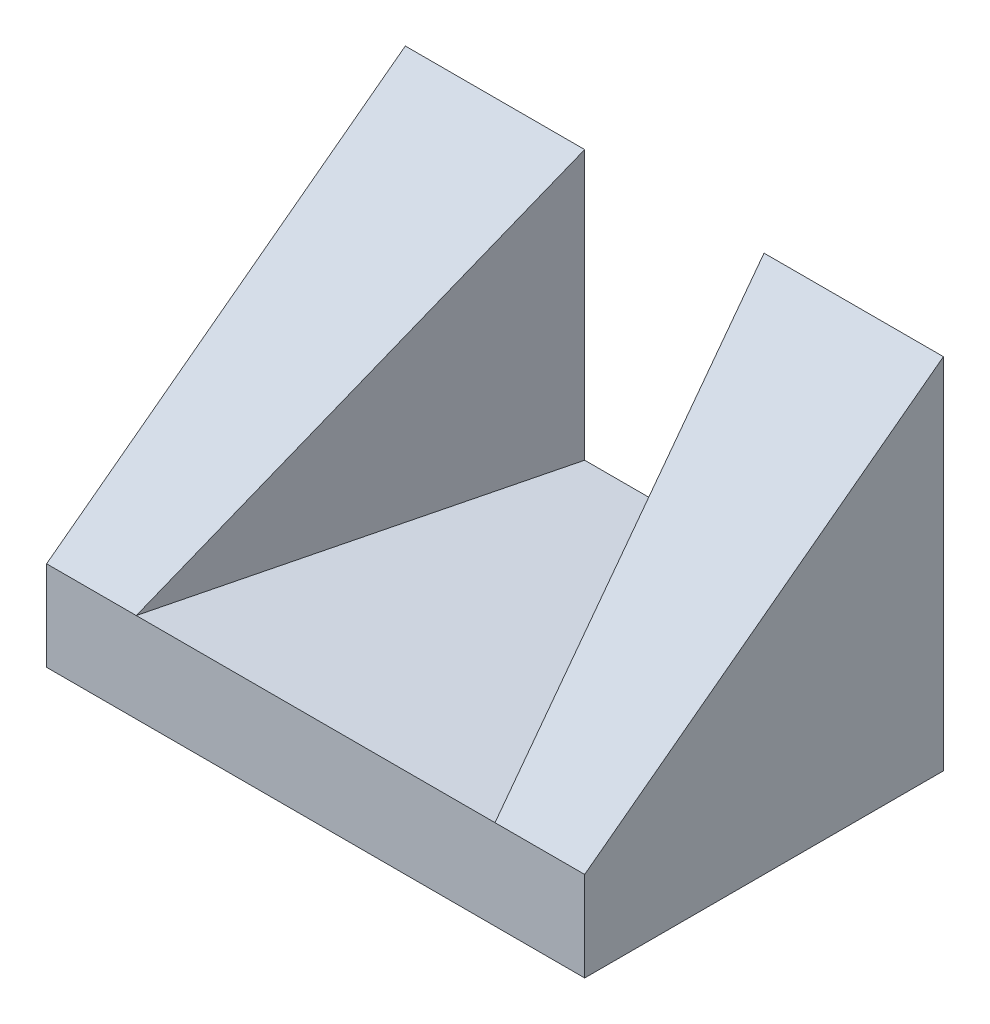
ISO-10303-21;
HEADER;
FILE_DESCRIPTION(('STEP AP214'),'2;1');
FILE_NAME('part.step','',(''),(''),'','','');
FILE_SCHEMA(('AUTOMOTIVE_DESIGN { 1 0 10303 214 1 1 1 1 }'));
ENDSEC;
DATA;
#1=APPLICATION_CONTEXT('core data for automotive mechanical design processes');
#2=APPLICATION_PROTOCOL_DEFINITION('international standard','automotive_design',2000,#1);
#3=PRODUCT_CONTEXT('',#1,'mechanical');
#4=PRODUCT('Part','Part','',(#3));
#5=PRODUCT_RELATED_PRODUCT_CATEGORY('part','',(#4));
#6=PRODUCT_DEFINITION_FORMATION('','',#4);
#7=PRODUCT_DEFINITION_CONTEXT('part definition',#1,'design');
#8=PRODUCT_DEFINITION('design','',#6,#7);
#9=PRODUCT_DEFINITION_SHAPE('','',#8);
#10=(LENGTH_UNIT() NAMED_UNIT(*) SI_UNIT(.MILLI.,.METRE.));
#11=(NAMED_UNIT(*) PLANE_ANGLE_UNIT() SI_UNIT($,.RADIAN.));
#12=(NAMED_UNIT(*) SI_UNIT($,.STERADIAN.) SOLID_ANGLE_UNIT());
#13=UNCERTAINTY_MEASURE_WITH_UNIT(LENGTH_MEASURE(1.E-05),#10,'distance_accuracy_value','');
#14=(GEOMETRIC_REPRESENTATION_CONTEXT(3) GLOBAL_UNCERTAINTY_ASSIGNED_CONTEXT((#13)) GLOBAL_UNIT_ASSIGNED_CONTEXT((#10,
#11,#12)) REPRESENTATION_CONTEXT('',''));
#15=CARTESIAN_POINT('',(0.,0.,0.));
#16=DIRECTION('',(0.,0.,1.));
#17=DIRECTION('',(1.,0.,0.));
#18=AXIS2_PLACEMENT_3D('',#15,#16,#17);
#19=CARTESIAN_POINT('',(0.,1.,0.));
#20=DIRECTION('',(0.,1.,0.));
#21=DIRECTION('',(0.,0.,1.));
#22=AXIS2_PLACEMENT_3D('',#19,#20,#21);
#23=PLANE('',#22);
#24=DIRECTION('',(1.,0.,0.));
#25=VECTOR('',#24,1.);
#26=CARTESIAN_POINT('',(0.,1.,2.));
#27=LINE('',#26,#25);
#28=CARTESIAN_POINT('',(-2.,1.,2.));
#29=VERTEX_POINT('',#28);
#30=CARTESIAN_POINT('',(2.,1.,2.));
#31=VERTEX_POINT('',#30);
#32=EDGE_CURVE('E119',#29,#31,#27,.T.);
#33=ORIENTED_EDGE('',*,*,#32,.T.);
#34=DIRECTION('',(-0.242535625036333,0.,-0.970142500145332));
#35=VECTOR('',#34,1.);
#36=CARTESIAN_POINT('',(1.41176470588235,1.,-0.352941176470589));
#37=LINE('',#36,#35);
#38=CARTESIAN_POINT('',(1.,1.,-2.));
#39=VERTEX_POINT('',#38);
#40=EDGE_CURVE('E50',#31,#39,#37,.T.);
#41=ORIENTED_EDGE('',*,*,#40,.T.);
#42=DIRECTION('',(1.,0.,0.));
#43=VECTOR('',#42,1.);
#44=CARTESIAN_POINT('',(0.,1.,-2.));
#45=LINE('',#44,#43);
#46=CARTESIAN_POINT('',(-0.999999999999999,1.,-2.));
#47=VERTEX_POINT('',#46);
#48=EDGE_CURVE('E124',#47,#39,#45,.T.);
#49=ORIENTED_EDGE('',*,*,#48,.F.);
#50=DIRECTION('',(0.242535625036333,0.,-0.970142500145332));
#51=VECTOR('',#50,1.);
#52=CARTESIAN_POINT('',(-1.41176470588235,1.,-0.352941176470587));
#53=LINE('',#52,#51);
#54=EDGE_CURVE('E129',#29,#47,#53,.T.);
#55=ORIENTED_EDGE('',*,*,#54,.F.);
#56=EDGE_LOOP('',(#33,#41,#49,#55));
#57=FACE_BOUND('',#56,.T.);
#58=ADVANCED_FACE('F35',(#57),#23,.T.);
#59=CARTESIAN_POINT('',(0.,1.,-2.));
#60=DIRECTION('',(0.,0.,-1.));
#61=DIRECTION('',(-1.,0.,0.));
#62=AXIS2_PLACEMENT_3D('',#59,#60,#61);
#63=PLANE('',#62);
#64=DIRECTION('',(0.,-1.,0.));
#65=VECTOR('',#64,1.);
#66=CARTESIAN_POINT('',(3.,1.,-2.));
#67=LINE('',#66,#65);
#68=CARTESIAN_POINT('',(3.,4.,-2.));
#69=VERTEX_POINT('',#68);
#70=CARTESIAN_POINT('',(3.,0.,-2.));
#71=VERTEX_POINT('',#70);
#72=EDGE_CURVE('E112',#69,#71,#67,.T.);
#73=ORIENTED_EDGE('',*,*,#72,.T.);
#74=DIRECTION('',(1.,0.,0.));
#75=VECTOR('',#74,1.);
#76=CARTESIAN_POINT('',(0.,0.,-2.));
#77=LINE('',#76,#75);
#78=CARTESIAN_POINT('',(-3.,0.,-2.));
#79=VERTEX_POINT('',#78);
#80=EDGE_CURVE('E58',#79,#71,#77,.T.);
#81=ORIENTED_EDGE('',*,*,#80,.F.);
#82=DIRECTION('',(0.,-1.,0.));
#83=VECTOR('',#82,1.);
#84=CARTESIAN_POINT('',(-3.,1.,-2.));
#85=LINE('',#84,#83);
#86=CARTESIAN_POINT('',(-3.,4.,-2.));
#87=VERTEX_POINT('',#86);
#88=EDGE_CURVE('E11',#87,#79,#85,.T.);
#89=ORIENTED_EDGE('',*,*,#88,.F.);
#90=DIRECTION('',(1.,0.,0.));
#91=VECTOR('',#90,1.);
#92=CARTESIAN_POINT('',(0.,4.,-2.));
#93=LINE('',#92,#91);
#94=CARTESIAN_POINT('',(-0.999999999999999,4.,-2.));
#95=VERTEX_POINT('',#94);
#96=EDGE_CURVE('E137',#87,#95,#93,.T.);
#97=ORIENTED_EDGE('',*,*,#96,.T.);
#98=DIRECTION('',(0.,-1.,0.));
#99=VECTOR('',#98,1.);
#100=CARTESIAN_POINT('',(-0.999999999999999,4.,-2.));
#101=LINE('',#100,#99);
#102=EDGE_CURVE('E134',#95,#47,#101,.T.);
#103=ORIENTED_EDGE('',*,*,#102,.T.);
#104=ORIENTED_EDGE('',*,*,#48,.T.);
#105=DIRECTION('',(0.,-1.,0.));
#106=VECTOR('',#105,1.);
#107=CARTESIAN_POINT('',(1.,4.,-2.));
#108=LINE('',#107,#106);
#109=CARTESIAN_POINT('',(1.,4.,-2.));
#110=VERTEX_POINT('',#109);
#111=EDGE_CURVE('E141',#110,#39,#108,.T.);
#112=ORIENTED_EDGE('',*,*,#111,.F.);
#113=DIRECTION('',(1.,0.,0.));
#114=VECTOR('',#113,1.);
#115=CARTESIAN_POINT('',(0.,4.,-2.));
#116=LINE('',#115,#114);
#117=EDGE_CURVE('E144',#110,#69,#116,.T.);
#118=ORIENTED_EDGE('',*,*,#117,.T.);
#119=EDGE_LOOP('',(#73,#81,#89,#97,#103,#104,#112,#118));
#120=FACE_BOUND('',#119,.T.);
#121=ADVANCED_FACE('F37',(#120),#63,.T.);
#122=CARTESIAN_POINT('',(-3.,1.,0.));
#123=DIRECTION('',(-1.,0.,0.));
#124=DIRECTION('',(0.,0.,1.));
#125=AXIS2_PLACEMENT_3D('',#122,#123,#124);
#126=PLANE('',#125);
#127=DIRECTION('',(0.,-0.6,0.8));
#128=VECTOR('',#127,1.);
#129=CARTESIAN_POINT('',(-3.,1.96,0.72));
#130=LINE('',#129,#128);
#131=CARTESIAN_POINT('',(-3.,1.,2.));
#132=VERTEX_POINT('',#131);
#133=EDGE_CURVE('E146',#87,#132,#130,.T.);
#134=ORIENTED_EDGE('',*,*,#133,.F.);
#135=ORIENTED_EDGE('',*,*,#88,.T.);
#136=DIRECTION('',(0.,0.,-1.));
#137=VECTOR('',#136,1.);
#138=CARTESIAN_POINT('',(-3.,0.,0.));
#139=LINE('',#138,#137);
#140=CARTESIAN_POINT('',(-3.,0.,2.));
#141=VERTEX_POINT('',#140);
#142=EDGE_CURVE('E126',#141,#79,#139,.T.);
#143=ORIENTED_EDGE('',*,*,#142,.F.);
#144=DIRECTION('',(0.,-1.,0.));
#145=VECTOR('',#144,1.);
#146=CARTESIAN_POINT('',(-3.,1.,2.));
#147=LINE('',#146,#145);
#148=EDGE_CURVE('E43',#132,#141,#147,.T.);
#149=ORIENTED_EDGE('',*,*,#148,.F.);
#150=EDGE_LOOP('',(#134,#135,#143,#149));
#151=FACE_BOUND('',#150,.T.);
#152=ADVANCED_FACE('F178',(#151),#126,.T.);
#153=CARTESIAN_POINT('',(0.,1.,2.));
#154=DIRECTION('',(0.,0.,-1.));
#155=DIRECTION('',(-1.,0.,0.));
#156=AXIS2_PLACEMENT_3D('',#153,#154,#155);
#157=PLANE('',#156);
#158=DIRECTION('',(0.,-1.,0.));
#159=VECTOR('',#158,1.);
#160=CARTESIAN_POINT('',(3.,1.,2.));
#161=LINE('',#160,#159);
#162=CARTESIAN_POINT('',(3.,1.,2.));
#163=VERTEX_POINT('',#162);
#164=CARTESIAN_POINT('',(3.,0.,2.));
#165=VERTEX_POINT('',#164);
#166=EDGE_CURVE('E110',#163,#165,#161,.T.);
#167=ORIENTED_EDGE('',*,*,#166,.F.);
#168=DIRECTION('',(1.,0.,0.));
#169=VECTOR('',#168,1.);
#170=CARTESIAN_POINT('',(-6.,1.,2.));
#171=LINE('',#170,#169);
#172=EDGE_CURVE('E95',#31,#163,#171,.T.);
#173=ORIENTED_EDGE('',*,*,#172,.F.);
#174=ORIENTED_EDGE('',*,*,#32,.F.);
#175=EDGE_CURVE('E105',#132,#29,#171,.T.);
#176=ORIENTED_EDGE('',*,*,#175,.F.);
#177=ORIENTED_EDGE('',*,*,#148,.T.);
#178=DIRECTION('',(1.,0.,0.));
#179=VECTOR('',#178,1.);
#180=CARTESIAN_POINT('',(0.,0.,2.));
#181=LINE('',#180,#179);
#182=EDGE_CURVE('E117',#141,#165,#181,.T.);
#183=ORIENTED_EDGE('',*,*,#182,.T.);
#184=EDGE_LOOP('',(#167,#173,#174,#176,#177,#183));
#185=FACE_BOUND('',#184,.T.);
#186=ADVANCED_FACE('F115',(#185),#157,.F.);
#187=CARTESIAN_POINT('',(3.,1.,0.));
#188=DIRECTION('',(-1.,0.,0.));
#189=DIRECTION('',(0.,0.,1.));
#190=AXIS2_PLACEMENT_3D('',#187,#188,#189);
#191=PLANE('',#190);
#192=ORIENTED_EDGE('',*,*,#72,.F.);
#193=DIRECTION('',(0.,0.6,-0.8));
#194=VECTOR('',#193,1.);
#195=CARTESIAN_POINT('',(3.,4.,-2.));
#196=LINE('',#195,#194);
#197=EDGE_CURVE('E98',#163,#69,#196,.T.);
#198=ORIENTED_EDGE('',*,*,#197,.F.);
#199=ORIENTED_EDGE('',*,*,#166,.T.);
#200=DIRECTION('',(0.,0.,-1.));
#201=VECTOR('',#200,1.);
#202=CARTESIAN_POINT('',(3.,0.,0.));
#203=LINE('',#202,#201);
#204=EDGE_CURVE('E122',#165,#71,#203,.T.);
#205=ORIENTED_EDGE('',*,*,#204,.T.);
#206=EDGE_LOOP('',(#192,#198,#199,#205));
#207=FACE_BOUND('',#206,.T.);
#208=ADVANCED_FACE('F108',(#207),#191,.F.);
#209=CARTESIAN_POINT('',(0.,0.,0.));
#210=DIRECTION('',(0.,1.,0.));
#211=DIRECTION('',(0.,0.,1.));
#212=AXIS2_PLACEMENT_3D('',#209,#210,#211);
#213=PLANE('',#212);
#214=ORIENTED_EDGE('',*,*,#204,.F.);
#215=ORIENTED_EDGE('',*,*,#182,.F.);
#216=ORIENTED_EDGE('',*,*,#142,.T.);
#217=ORIENTED_EDGE('',*,*,#80,.T.);
#218=EDGE_LOOP('',(#214,#215,#216,#217));
#219=FACE_BOUND('',#218,.T.);
#220=ADVANCED_FACE('F171',(#219),#213,.F.);
#221=CARTESIAN_POINT('',(-1.41176470588235,4.,-0.352941176470587));
#222=DIRECTION('',(0.970142500145332,0.,0.242535625036333));
#223=DIRECTION('',(0.242535625036333,0.,-0.970142500145332));
#224=AXIS2_PLACEMENT_3D('',#221,#222,#223);
#225=PLANE('',#224);
#226=DIRECTION('',(0.196116135138184,0.588348405414552,-0.784464540552736));
#227=VECTOR('',#226,1.);
#228=CARTESIAN_POINT('',(-1.26923076923077,3.19230769230769,-0.923076923076922));
#229=LINE('',#228,#227);
#230=EDGE_CURVE('E148',#29,#95,#229,.T.);
#231=ORIENTED_EDGE('',*,*,#230,.F.);
#232=ORIENTED_EDGE('',*,*,#54,.T.);
#233=ORIENTED_EDGE('',*,*,#102,.F.);
#234=EDGE_LOOP('',(#231,#232,#233));
#235=FACE_BOUND('',#234,.T.);
#236=ADVANCED_FACE('F161',(#235),#225,.T.);
#237=CARTESIAN_POINT('',(1.41176470588235,4.,-0.352941176470589));
#238=DIRECTION('',(0.970142500145332,0.,-0.242535625036333));
#239=DIRECTION('',(-0.242535625036333,0.,-0.970142500145332));
#240=AXIS2_PLACEMENT_3D('',#237,#238,#239);
#241=PLANE('',#240);
#242=ORIENTED_EDGE('',*,*,#40,.F.);
#243=DIRECTION('',(-0.196116135138184,0.588348405414552,-0.784464540552736));
#244=VECTOR('',#243,1.);
#245=CARTESIAN_POINT('',(1.26923076923077,3.19230769230769,-0.923076923076923));
#246=LINE('',#245,#244);
#247=EDGE_CURVE('E101',#31,#110,#246,.T.);
#248=ORIENTED_EDGE('',*,*,#247,.T.);
#249=ORIENTED_EDGE('',*,*,#111,.T.);
#250=EDGE_LOOP('',(#242,#248,#249));
#251=FACE_BOUND('',#250,.T.);
#252=ADVANCED_FACE('F163',(#251),#241,.F.);
#253=CARTESIAN_POINT('',(-6.,4.,-2.));
#254=DIRECTION('',(0.,-0.8,-0.6));
#255=DIRECTION('',(0.,0.6,-0.8));
#256=AXIS2_PLACEMENT_3D('',#253,#254,#255);
#257=PLANE('',#256);
#258=ORIENTED_EDGE('',*,*,#172,.T.);
#259=ORIENTED_EDGE('',*,*,#197,.T.);
#260=ORIENTED_EDGE('',*,*,#117,.F.);
#261=ORIENTED_EDGE('',*,*,#247,.F.);
#262=EDGE_LOOP('',(#258,#259,#260,#261));
#263=FACE_BOUND('',#262,.T.);
#264=ADVANCED_FACE('F97',(#263),#257,.F.);
#265=ORIENTED_EDGE('',*,*,#133,.T.);
#266=ORIENTED_EDGE('',*,*,#175,.T.);
#267=ORIENTED_EDGE('',*,*,#230,.T.);
#268=ORIENTED_EDGE('',*,*,#96,.F.);
#269=EDGE_LOOP('',(#265,#266,#267,#268));
#270=FACE_BOUND('',#269,.T.);
#271=ADVANCED_FACE('F155',(#270),#257,.F.);
#272=CLOSED_SHELL('',(#58,#121,#152,#186,#208,#220,#236,#252,#264,#271));
#273=MANIFOLD_SOLID_BREP('B2',#272);
#274=ADVANCED_BREP_SHAPE_REPRESENTATION('',(#18,#273),#14);
#275=SHAPE_DEFINITION_REPRESENTATION(#9,#274);
ENDSEC;
END-ISO-10303-21;
